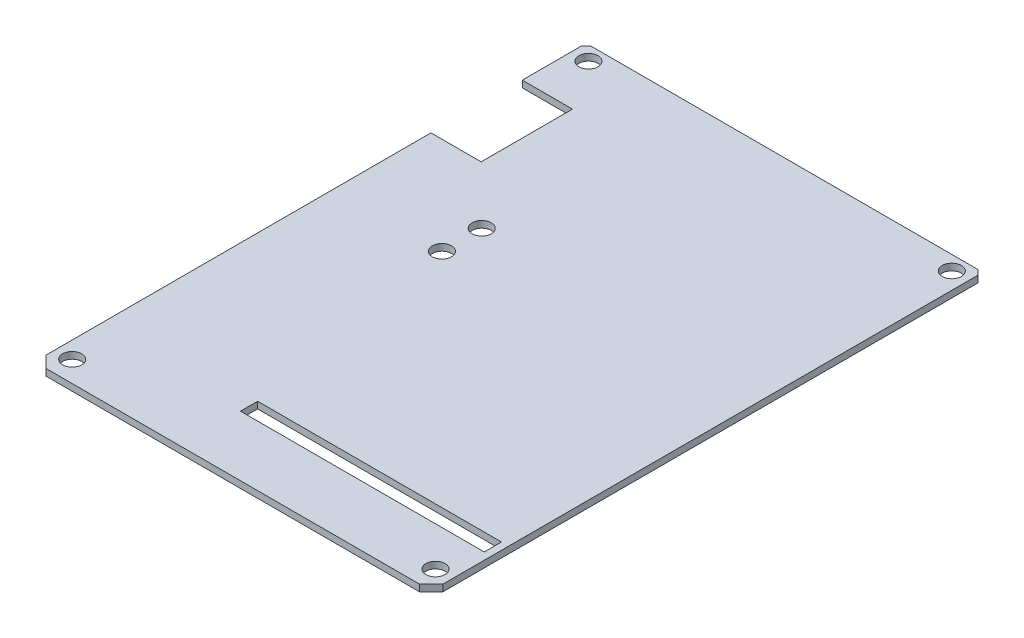
ISO-10303-21;
HEADER;
FILE_DESCRIPTION(('STEP AP214'),'2;1');
FILE_NAME('part.step','',(''),(''),'','','');
FILE_SCHEMA(('AUTOMOTIVE_DESIGN { 1 0 10303 214 1 1 1 1 }'));
ENDSEC;
DATA;
#1=APPLICATION_CONTEXT('core data for automotive mechanical design processes');
#2=APPLICATION_PROTOCOL_DEFINITION('international standard','automotive_design',2000,#1);
#3=PRODUCT_CONTEXT('',#1,'mechanical');
#4=PRODUCT('Part','Part','',(#3));
#5=PRODUCT_RELATED_PRODUCT_CATEGORY('part','',(#4));
#6=PRODUCT_DEFINITION_FORMATION('','',#4);
#7=PRODUCT_DEFINITION_CONTEXT('part definition',#1,'design');
#8=PRODUCT_DEFINITION('design','',#6,#7);
#9=PRODUCT_DEFINITION_SHAPE('','',#8);
#10=(LENGTH_UNIT() NAMED_UNIT(*) SI_UNIT(.MILLI.,.METRE.));
#11=(NAMED_UNIT(*) PLANE_ANGLE_UNIT() SI_UNIT($,.RADIAN.));
#12=(NAMED_UNIT(*) SI_UNIT($,.STERADIAN.) SOLID_ANGLE_UNIT());
#13=UNCERTAINTY_MEASURE_WITH_UNIT(LENGTH_MEASURE(1.E-05),#10,'distance_accuracy_value','');
#14=(GEOMETRIC_REPRESENTATION_CONTEXT(3) GLOBAL_UNCERTAINTY_ASSIGNED_CONTEXT((#13)) GLOBAL_UNIT_ASSIGNED_CONTEXT((#10,
#11,#12)) REPRESENTATION_CONTEXT('',''));
#15=CARTESIAN_POINT('',(0.,0.,0.));
#16=DIRECTION('',(0.,0.,1.));
#17=DIRECTION('',(1.,0.,0.));
#18=AXIS2_PLACEMENT_3D('',#15,#16,#17);
#19=CARTESIAN_POINT('',(-20.75,0.699999999999999,0.));
#20=DIRECTION('',(-1.,0.,0.));
#21=DIRECTION('',(0.,0.,1.));
#22=AXIS2_PLACEMENT_3D('',#19,#20,#21);
#23=PLANE('',#22);
#24=DIRECTION('',(0.,-1.,0.));
#25=VECTOR('',#24,1.);
#26=CARTESIAN_POINT('',(-20.75,0.699999999999999,-21.8236057052935));
#27=LINE('',#26,#25);
#28=CARTESIAN_POINT('',(-20.75,0.699999999999999,-21.8236057052935));
#29=VERTEX_POINT('',#28);
#30=CARTESIAN_POINT('',(-20.75,0.,-21.8236057052935));
#31=VERTEX_POINT('',#30);
#32=EDGE_CURVE('E63',#29,#31,#27,.T.);
#33=ORIENTED_EDGE('',*,*,#32,.F.);
#34=DIRECTION('',(0.,0.,-1.));
#35=VECTOR('',#34,1.);
#36=CARTESIAN_POINT('',(-20.75,0.699999999999999,0.));
#37=LINE('',#36,#35);
#38=CARTESIAN_POINT('',(-20.75,0.699999999999999,-27.9901394034831));
#39=VERTEX_POINT('',#38);
#40=EDGE_CURVE('E195',#29,#39,#37,.T.);
#41=ORIENTED_EDGE('',*,*,#40,.T.);
#42=DIRECTION('',(0.,-1.,0.));
#43=VECTOR('',#42,1.);
#44=CARTESIAN_POINT('',(-20.75,0.699999999999999,-27.9901394034831));
#45=LINE('',#44,#43);
#46=CARTESIAN_POINT('',(-20.75,0.,-27.9901394034831));
#47=VERTEX_POINT('',#46);
#48=EDGE_CURVE('E269',#39,#47,#45,.T.);
#49=ORIENTED_EDGE('',*,*,#48,.T.);
#50=DIRECTION('',(0.,0.,-1.));
#51=VECTOR('',#50,1.);
#52=CARTESIAN_POINT('',(-20.75,0.,0.));
#53=LINE('',#52,#51);
#54=EDGE_CURVE('E250',#31,#47,#53,.T.);
#55=ORIENTED_EDGE('',*,*,#54,.F.);
#56=EDGE_LOOP('',(#33,#41,#49,#55));
#57=FACE_BOUND('',#56,.T.);
#58=ADVANCED_FACE('F54',(#57),#23,.T.);
#59=CARTESIAN_POINT('',(0.,0.699999999999999,0.));
#60=DIRECTION('',(0.,1.,0.));
#61=DIRECTION('',(0.,0.,1.));
#62=AXIS2_PLACEMENT_3D('',#59,#60,#61);
#63=PLANE('',#62);
#64=DIRECTION('',(-1.,0.,0.));
#65=VECTOR('',#64,1.);
#66=CARTESIAN_POINT('',(-20.75,0.699999999999999,-21.8236057052935));
#67=LINE('',#66,#65);
#68=CARTESIAN_POINT('',(-15.5,0.699999999999999,-21.8236057052935));
#69=VERTEX_POINT('',#68);
#70=EDGE_CURVE('E303',#69,#29,#67,.T.);
#71=ORIENTED_EDGE('',*,*,#70,.F.);
#72=DIRECTION('',(0.,0.,-1.));
#73=VECTOR('',#72,1.);
#74=CARTESIAN_POINT('',(-15.5,0.699999999999999,-21.8236057052935));
#75=LINE('',#74,#73);
#76=CARTESIAN_POINT('',(-15.5,0.699999999999999,-12.2736057052935));
#77=VERTEX_POINT('',#76);
#78=EDGE_CURVE('E187',#77,#69,#75,.T.);
#79=ORIENTED_EDGE('',*,*,#78,.F.);
#80=DIRECTION('',(1.,0.,0.));
#81=VECTOR('',#80,1.);
#82=CARTESIAN_POINT('',(-20.75,0.699999999999999,-12.2736057052935));
#83=LINE('',#82,#81);
#84=CARTESIAN_POINT('',(-20.75,0.699999999999999,-12.2736057052935));
#85=VERTEX_POINT('',#84);
#86=EDGE_CURVE('E171',#85,#77,#83,.T.);
#87=ORIENTED_EDGE('',*,*,#86,.F.);
#88=CARTESIAN_POINT('',(-20.75,0.699999999999999,27.9901394034831));
#89=VERTEX_POINT('',#88);
#90=EDGE_CURVE('E185',#89,#85,#37,.T.);
#91=ORIENTED_EDGE('',*,*,#90,.F.);
#92=DIRECTION('',(0.707106781186546,0.,0.707106781186549));
#93=VECTOR('',#92,1.);
#94=CARTESIAN_POINT('',(-24.3700697017416,0.699999999999999,24.3700697017415));
#95=LINE('',#94,#93);
#96=CARTESIAN_POINT('',(-19.5401394034831,0.699999999999999,29.2));
#97=VERTEX_POINT('',#96);
#98=EDGE_CURVE('E194',#89,#97,#95,.T.);
#99=ORIENTED_EDGE('',*,*,#98,.T.);
#100=DIRECTION('',(1.,0.,0.));
#101=VECTOR('',#100,1.);
#102=CARTESIAN_POINT('',(-19.5401394034831,0.699999999999999,29.2));
#103=LINE('',#102,#101);
#104=CARTESIAN_POINT('',(19.5401394034831,0.699999999999999,29.2));
#105=VERTEX_POINT('',#104);
#106=EDGE_CURVE('E311',#97,#105,#103,.T.);
#107=ORIENTED_EDGE('',*,*,#106,.T.);
#108=DIRECTION('',(-0.707106781186546,0.,0.707106781186549));
#109=VECTOR('',#108,1.);
#110=CARTESIAN_POINT('',(24.3700697017416,0.699999999999999,24.3700697017415));
#111=LINE('',#110,#109);
#112=CARTESIAN_POINT('',(20.75,0.699999999999999,27.9901394034831));
#113=VERTEX_POINT('',#112);
#114=EDGE_CURVE('E200',#113,#105,#111,.T.);
#115=ORIENTED_EDGE('',*,*,#114,.F.);
#116=DIRECTION('',(0.,0.,1.));
#117=VECTOR('',#116,1.);
#118=CARTESIAN_POINT('',(20.75,0.699999999999999,0.));
#119=LINE('',#118,#117);
#120=CARTESIAN_POINT('',(20.75,0.699999999999999,-27.9901394034831));
#121=VERTEX_POINT('',#120);
#122=EDGE_CURVE('E419',#121,#113,#119,.T.);
#123=ORIENTED_EDGE('',*,*,#122,.F.);
#124=DIRECTION('',(-0.707106781186546,0.,-0.707106781186549));
#125=VECTOR('',#124,1.);
#126=CARTESIAN_POINT('',(24.3700697017416,0.699999999999999,-24.3700697017415));
#127=LINE('',#126,#125);
#128=CARTESIAN_POINT('',(20.2401394034831,0.699999999999999,-28.5));
#129=VERTEX_POINT('',#128);
#130=EDGE_CURVE('E423',#121,#129,#127,.T.);
#131=ORIENTED_EDGE('',*,*,#130,.T.);
#132=DIRECTION('',(1.,0.,0.));
#133=VECTOR('',#132,1.);
#134=CARTESIAN_POINT('',(0.,0.699999999999999,-28.5));
#135=LINE('',#134,#133);
#136=CARTESIAN_POINT('',(-20.2401394034831,0.699999999999999,-28.5));
#137=VERTEX_POINT('',#136);
#138=EDGE_CURVE('E425',#137,#129,#135,.T.);
#139=ORIENTED_EDGE('',*,*,#138,.F.);
#140=DIRECTION('',(0.707106781186546,0.,-0.707106781186549));
#141=VECTOR('',#140,1.);
#142=CARTESIAN_POINT('',(-24.3700697017416,0.699999999999999,-24.3700697017415));
#143=LINE('',#142,#141);
#144=EDGE_CURVE('E202',#39,#137,#143,.T.);
#145=ORIENTED_EDGE('',*,*,#144,.F.);
#146=ORIENTED_EDGE('',*,*,#40,.F.);
#147=EDGE_LOOP('',(#71,#79,#87,#91,#99,#107,#115,#123,#131,#139,#145,#146));
#148=FACE_BOUND('',#147,.T.);
#149=CARTESIAN_POINT('',(-9.45,0.699999999999999,-2.11546981112506));
#150=DIRECTION('',(0.,1.,0.));
#151=DIRECTION('',(0.,0.,1.));
#152=AXIS2_PLACEMENT_3D('',#149,#150,#151);
#153=CIRCLE('',#152,1.);
#154=CARTESIAN_POINT('',(-9.45,0.699999999999999,-1.11546981112506));
#155=VERTEX_POINT('',#154);
#156=EDGE_CURVE('E264',#155,#155,#153,.T.);
#157=ORIENTED_EDGE('',*,*,#156,.F.);
#158=EDGE_LOOP('',(#157));
#159=FACE_BOUND('',#158,.T.);
#160=CARTESIAN_POINT('',(-19.,0.699999999999999,-27.));
#161=DIRECTION('',(0.,1.,0.));
#162=DIRECTION('',(0.,0.,1.));
#163=AXIS2_PLACEMENT_3D('',#160,#161,#162);
#164=CIRCLE('',#163,1.);
#165=CARTESIAN_POINT('',(-19.,0.699999999999999,-26.));
#166=VERTEX_POINT('',#165);
#167=EDGE_CURVE('E403',#166,#166,#164,.F.);
#168=ORIENTED_EDGE('',*,*,#167,.T.);
#169=EDGE_LOOP('',(#168));
#170=FACE_BOUND('',#169,.T.);
#171=CARTESIAN_POINT('',(19.,0.699999999999999,27.));
#172=DIRECTION('',(0.,1.,0.));
#173=DIRECTION('',(0.,0.,1.));
#174=AXIS2_PLACEMENT_3D('',#171,#172,#173);
#175=CIRCLE('',#174,1.);
#176=CARTESIAN_POINT('',(19.,0.699999999999999,28.));
#177=VERTEX_POINT('',#176);
#178=EDGE_CURVE('E407',#177,#177,#175,.T.);
#179=ORIENTED_EDGE('',*,*,#178,.F.);
#180=EDGE_LOOP('',(#179));
#181=FACE_BOUND('',#180,.T.);
#182=CARTESIAN_POINT('',(-19.,0.699999999999999,27.));
#183=DIRECTION('',(0.,1.,0.));
#184=DIRECTION('',(0.,0.,1.));
#185=AXIS2_PLACEMENT_3D('',#182,#183,#184);
#186=CIRCLE('',#185,1.);
#187=CARTESIAN_POINT('',(-19.,0.699999999999999,28.));
#188=VERTEX_POINT('',#187);
#189=EDGE_CURVE('E411',#188,#188,#186,.T.);
#190=ORIENTED_EDGE('',*,*,#189,.F.);
#191=EDGE_LOOP('',(#190));
#192=FACE_BOUND('',#191,.T.);
#193=CARTESIAN_POINT('',(-9.45,0.699999999999999,-6.28453018887489));
#194=DIRECTION('',(0.,1.,0.));
#195=DIRECTION('',(0.,0.,1.));
#196=AXIS2_PLACEMENT_3D('',#193,#194,#195);
#197=CIRCLE('',#196,0.999999999999998);
#198=CARTESIAN_POINT('',(-9.45,0.699999999999999,-5.28453018887489));
#199=VERTEX_POINT('',#198);
#200=EDGE_CURVE('E415',#199,#199,#197,.T.);
#201=ORIENTED_EDGE('',*,*,#200,.F.);
#202=EDGE_LOOP('',(#201));
#203=FACE_BOUND('',#202,.T.);
#204=CARTESIAN_POINT('',(19.,0.699999999999999,-27.));
#205=DIRECTION('',(0.,1.,0.));
#206=DIRECTION('',(0.,0.,1.));
#207=AXIS2_PLACEMENT_3D('',#204,#205,#206);
#208=CIRCLE('',#207,1.);
#209=CARTESIAN_POINT('',(19.,0.699999999999999,-26.));
#210=VERTEX_POINT('',#209);
#211=EDGE_CURVE('E208',#210,#210,#208,.F.);
#212=ORIENTED_EDGE('',*,*,#211,.T.);
#213=EDGE_LOOP('',(#212));
#214=FACE_BOUND('',#213,.T.);
#215=DIRECTION('',(0.,0.,1.));
#216=VECTOR('',#215,1.);
#217=CARTESIAN_POINT('',(-5.50287843796126,0.699999999999999,0.));
#218=LINE('',#217,#216);
#219=CARTESIAN_POINT('',(-5.50287843796126,0.699999999999999,21.1));
#220=VERTEX_POINT('',#219);
#221=CARTESIAN_POINT('',(-5.50287843796126,0.699999999999999,22.9));
#222=VERTEX_POINT('',#221);
#223=EDGE_CURVE('E352',#220,#222,#218,.T.);
#224=ORIENTED_EDGE('',*,*,#223,.F.);
#225=DIRECTION('',(1.,0.,0.));
#226=VECTOR('',#225,1.);
#227=CARTESIAN_POINT('',(0.,0.699999999999999,21.1));
#228=LINE('',#227,#226);
#229=CARTESIAN_POINT('',(20.,0.699999999999999,21.1));
#230=VERTEX_POINT('',#229);
#231=EDGE_CURVE('E78',#220,#230,#228,.T.);
#232=ORIENTED_EDGE('',*,*,#231,.T.);
#233=DIRECTION('',(0.,0.,-1.));
#234=VECTOR('',#233,1.);
#235=CARTESIAN_POINT('',(20.,0.699999999999999,0.));
#236=LINE('',#235,#234);
#237=CARTESIAN_POINT('',(20.,0.699999999999999,22.9));
#238=VERTEX_POINT('',#237);
#239=EDGE_CURVE('E342',#238,#230,#236,.T.);
#240=ORIENTED_EDGE('',*,*,#239,.F.);
#241=DIRECTION('',(1.,0.,0.));
#242=VECTOR('',#241,1.);
#243=CARTESIAN_POINT('',(0.,0.699999999999999,22.9));
#244=LINE('',#243,#242);
#245=EDGE_CURVE('E347',#222,#238,#244,.T.);
#246=ORIENTED_EDGE('',*,*,#245,.F.);
#247=EDGE_LOOP('',(#224,#232,#240,#246));
#248=FACE_BOUND('',#247,.T.);
#249=ADVANCED_FACE('F183',(#148,#159,#170,#181,#192,#203,#214,#248),#63,.T.);
#250=CARTESIAN_POINT('',(0.,0.,0.));
#251=DIRECTION('',(0.,1.,0.));
#252=DIRECTION('',(0.,0.,1.));
#253=AXIS2_PLACEMENT_3D('',#250,#251,#252);
#254=PLANE('',#253);
#255=CARTESIAN_POINT('',(19.,0.,-27.));
#256=DIRECTION('',(0.,1.,0.));
#257=DIRECTION('',(0.,0.,1.));
#258=AXIS2_PLACEMENT_3D('',#255,#256,#257);
#259=CIRCLE('',#258,1.);
#260=CARTESIAN_POINT('',(19.,0.,-26.));
#261=VERTEX_POINT('',#260);
#262=EDGE_CURVE('E260',#261,#261,#259,.F.);
#263=ORIENTED_EDGE('',*,*,#262,.F.);
#264=EDGE_LOOP('',(#263));
#265=FACE_BOUND('',#264,.T.);
#266=DIRECTION('',(0.,0.,-1.));
#267=VECTOR('',#266,1.);
#268=CARTESIAN_POINT('',(-15.5,0.,0.));
#269=LINE('',#268,#267);
#270=CARTESIAN_POINT('',(-15.5,0.,-12.2736057052935));
#271=VERTEX_POINT('',#270);
#272=CARTESIAN_POINT('',(-15.5,0.,-21.8236057052935));
#273=VERTEX_POINT('',#272);
#274=EDGE_CURVE('E13',#271,#273,#269,.T.);
#275=ORIENTED_EDGE('',*,*,#274,.T.);
#276=DIRECTION('',(-1.,0.,0.));
#277=VECTOR('',#276,1.);
#278=CARTESIAN_POINT('',(0.,0.,-21.8236057052935));
#279=LINE('',#278,#277);
#280=EDGE_CURVE('E301',#273,#31,#279,.T.);
#281=ORIENTED_EDGE('',*,*,#280,.T.);
#282=ORIENTED_EDGE('',*,*,#54,.T.);
#283=DIRECTION('',(0.707106781186546,0.,-0.707106781186549));
#284=VECTOR('',#283,1.);
#285=CARTESIAN_POINT('',(-24.3700697017416,0.,-24.3700697017415));
#286=LINE('',#285,#284);
#287=CARTESIAN_POINT('',(-20.2401394034831,0.,-28.5));
#288=VERTEX_POINT('',#287);
#289=EDGE_CURVE('E246',#47,#288,#286,.T.);
#290=ORIENTED_EDGE('',*,*,#289,.T.);
#291=DIRECTION('',(1.,0.,0.));
#292=VECTOR('',#291,1.);
#293=CARTESIAN_POINT('',(0.,0.,-28.5));
#294=LINE('',#293,#292);
#295=CARTESIAN_POINT('',(20.2401394034831,0.,-28.5));
#296=VERTEX_POINT('',#295);
#297=EDGE_CURVE('E242',#288,#296,#294,.T.);
#298=ORIENTED_EDGE('',*,*,#297,.T.);
#299=DIRECTION('',(-0.707106781186546,0.,-0.707106781186549));
#300=VECTOR('',#299,1.);
#301=CARTESIAN_POINT('',(24.3700697017416,0.,-24.3700697017415));
#302=LINE('',#301,#300);
#303=CARTESIAN_POINT('',(20.75,0.,-27.9901394034831));
#304=VERTEX_POINT('',#303);
#305=EDGE_CURVE('E238',#304,#296,#302,.T.);
#306=ORIENTED_EDGE('',*,*,#305,.F.);
#307=DIRECTION('',(0.,0.,1.));
#308=VECTOR('',#307,1.);
#309=CARTESIAN_POINT('',(20.75,0.,0.));
#310=LINE('',#309,#308);
#311=CARTESIAN_POINT('',(20.75,0.,27.9901394034831));
#312=VERTEX_POINT('',#311);
#313=EDGE_CURVE('E234',#304,#312,#310,.T.);
#314=ORIENTED_EDGE('',*,*,#313,.T.);
#315=DIRECTION('',(-0.707106781186546,0.,0.707106781186549));
#316=VECTOR('',#315,1.);
#317=CARTESIAN_POINT('',(24.3700697017416,0.,24.3700697017415));
#318=LINE('',#317,#316);
#319=CARTESIAN_POINT('',(19.5401394034831,0.,29.2));
#320=VERTEX_POINT('',#319);
#321=EDGE_CURVE('E257',#312,#320,#318,.T.);
#322=ORIENTED_EDGE('',*,*,#321,.T.);
#323=DIRECTION('',(-1.,0.,0.));
#324=VECTOR('',#323,1.);
#325=CARTESIAN_POINT('',(-19.5401394034831,0.,29.2));
#326=LINE('',#325,#324);
#327=CARTESIAN_POINT('',(-19.5401394034831,0.,29.2));
#328=VERTEX_POINT('',#327);
#329=EDGE_CURVE('E360',#320,#328,#326,.T.);
#330=ORIENTED_EDGE('',*,*,#329,.T.);
#331=DIRECTION('',(0.707106781186546,0.,0.707106781186549));
#332=VECTOR('',#331,1.);
#333=CARTESIAN_POINT('',(-24.3700697017416,0.,24.3700697017415));
#334=LINE('',#333,#332);
#335=CARTESIAN_POINT('',(-20.75,0.,27.9901394034831));
#336=VERTEX_POINT('',#335);
#337=EDGE_CURVE('E254',#336,#328,#334,.T.);
#338=ORIENTED_EDGE('',*,*,#337,.F.);
#339=CARTESIAN_POINT('',(-20.75,0.,-12.2736057052935));
#340=VERTEX_POINT('',#339);
#341=EDGE_CURVE('E251',#336,#340,#53,.T.);
#342=ORIENTED_EDGE('',*,*,#341,.T.);
#343=DIRECTION('',(1.,0.,0.));
#344=VECTOR('',#343,1.);
#345=CARTESIAN_POINT('',(0.,0.,-12.2736057052935));
#346=LINE('',#345,#344);
#347=EDGE_CURVE('E70',#340,#271,#346,.T.);
#348=ORIENTED_EDGE('',*,*,#347,.T.);
#349=EDGE_LOOP('',(#275,#281,#282,#290,#298,#306,#314,#322,#330,#338,#342,#348));
#350=FACE_BOUND('',#349,.T.);
#351=CARTESIAN_POINT('',(-9.45,0.,-6.28453018887489));
#352=DIRECTION('',(0.,1.,0.));
#353=DIRECTION('',(0.,0.,1.));
#354=AXIS2_PLACEMENT_3D('',#351,#352,#353);
#355=CIRCLE('',#354,0.999999999999998);
#356=CARTESIAN_POINT('',(-9.45,0.,-5.28453018887489));
#357=VERTEX_POINT('',#356);
#358=EDGE_CURVE('E230',#357,#357,#355,.T.);
#359=ORIENTED_EDGE('',*,*,#358,.T.);
#360=EDGE_LOOP('',(#359));
#361=FACE_BOUND('',#360,.T.);
#362=CARTESIAN_POINT('',(-19.,0.,27.));
#363=DIRECTION('',(0.,1.,0.));
#364=DIRECTION('',(0.,0.,1.));
#365=AXIS2_PLACEMENT_3D('',#362,#363,#364);
#366=CIRCLE('',#365,1.);
#367=CARTESIAN_POINT('',(-19.,0.,28.));
#368=VERTEX_POINT('',#367);
#369=EDGE_CURVE('E226',#368,#368,#366,.T.);
#370=ORIENTED_EDGE('',*,*,#369,.T.);
#371=EDGE_LOOP('',(#370));
#372=FACE_BOUND('',#371,.T.);
#373=CARTESIAN_POINT('',(19.,0.,27.));
#374=DIRECTION('',(0.,1.,0.));
#375=DIRECTION('',(0.,0.,1.));
#376=AXIS2_PLACEMENT_3D('',#373,#374,#375);
#377=CIRCLE('',#376,1.);
#378=CARTESIAN_POINT('',(19.,0.,28.));
#379=VERTEX_POINT('',#378);
#380=EDGE_CURVE('E222',#379,#379,#377,.T.);
#381=ORIENTED_EDGE('',*,*,#380,.T.);
#382=EDGE_LOOP('',(#381));
#383=FACE_BOUND('',#382,.T.);
#384=CARTESIAN_POINT('',(-19.,0.,-27.));
#385=DIRECTION('',(0.,1.,0.));
#386=DIRECTION('',(0.,0.,1.));
#387=AXIS2_PLACEMENT_3D('',#384,#385,#386);
#388=CIRCLE('',#387,1.);
#389=CARTESIAN_POINT('',(-19.,0.,-26.));
#390=VERTEX_POINT('',#389);
#391=EDGE_CURVE('E217',#390,#390,#388,.F.);
#392=ORIENTED_EDGE('',*,*,#391,.F.);
#393=EDGE_LOOP('',(#392));
#394=FACE_BOUND('',#393,.T.);
#395=CARTESIAN_POINT('',(-9.45,0.,-2.11546981112506));
#396=DIRECTION('',(0.,1.,0.));
#397=DIRECTION('',(0.,0.,1.));
#398=AXIS2_PLACEMENT_3D('',#395,#396,#397);
#399=CIRCLE('',#398,1.);
#400=CARTESIAN_POINT('',(-9.45,0.,-1.11546981112506));
#401=VERTEX_POINT('',#400);
#402=EDGE_CURVE('E213',#401,#401,#399,.T.);
#403=ORIENTED_EDGE('',*,*,#402,.T.);
#404=EDGE_LOOP('',(#403));
#405=FACE_BOUND('',#404,.T.);
#406=DIRECTION('',(1.,0.,0.));
#407=VECTOR('',#406,1.);
#408=CARTESIAN_POINT('',(0.,0.,21.1));
#409=LINE('',#408,#407);
#410=CARTESIAN_POINT('',(-5.50287843796126,0.,21.1));
#411=VERTEX_POINT('',#410);
#412=CARTESIAN_POINT('',(20.,0.,21.1));
#413=VERTEX_POINT('',#412);
#414=EDGE_CURVE('E178',#411,#413,#409,.T.);
#415=ORIENTED_EDGE('',*,*,#414,.F.);
#416=DIRECTION('',(0.,0.,1.));
#417=VECTOR('',#416,1.);
#418=CARTESIAN_POINT('',(-5.50287843796126,0.,0.));
#419=LINE('',#418,#417);
#420=CARTESIAN_POINT('',(-5.50287843796126,0.,22.9));
#421=VERTEX_POINT('',#420);
#422=EDGE_CURVE('E282',#411,#421,#419,.T.);
#423=ORIENTED_EDGE('',*,*,#422,.T.);
#424=DIRECTION('',(1.,0.,0.));
#425=VECTOR('',#424,1.);
#426=CARTESIAN_POINT('',(0.,0.,22.9));
#427=LINE('',#426,#425);
#428=CARTESIAN_POINT('',(20.,0.,22.9));
#429=VERTEX_POINT('',#428);
#430=EDGE_CURVE('E286',#421,#429,#427,.T.);
#431=ORIENTED_EDGE('',*,*,#430,.T.);
#432=DIRECTION('',(0.,0.,-1.));
#433=VECTOR('',#432,1.);
#434=CARTESIAN_POINT('',(20.,0.,0.));
#435=LINE('',#434,#433);
#436=EDGE_CURVE('E290',#429,#413,#435,.T.);
#437=ORIENTED_EDGE('',*,*,#436,.T.);
#438=EDGE_LOOP('',(#415,#423,#431,#437));
#439=FACE_BOUND('',#438,.T.);
#440=ADVANCED_FACE('F308',(#265,#350,#361,#372,#383,#394,#405,#439),#254,.F.);
#441=CARTESIAN_POINT('',(20.75,0.699999999999999,0.));
#442=DIRECTION('',(1.,0.,0.));
#443=DIRECTION('',(0.,0.,-1.));
#444=AXIS2_PLACEMENT_3D('',#441,#442,#443);
#445=PLANE('',#444);
#446=ORIENTED_EDGE('',*,*,#313,.F.);
#447=DIRECTION('',(0.,-1.,0.));
#448=VECTOR('',#447,1.);
#449=CARTESIAN_POINT('',(20.75,0.699999999999999,-27.9901394034831));
#450=LINE('',#449,#448);
#451=EDGE_CURVE('E279',#121,#304,#450,.T.);
#452=ORIENTED_EDGE('',*,*,#451,.F.);
#453=ORIENTED_EDGE('',*,*,#122,.T.);
#454=DIRECTION('',(0.,-1.,0.));
#455=VECTOR('',#454,1.);
#456=CARTESIAN_POINT('',(20.75,0.699999999999999,27.9901394034831));
#457=LINE('',#456,#455);
#458=EDGE_CURVE('E212',#113,#312,#457,.T.);
#459=ORIENTED_EDGE('',*,*,#458,.T.);
#460=EDGE_LOOP('',(#446,#452,#453,#459));
#461=FACE_BOUND('',#460,.T.);
#462=ADVANCED_FACE('F449',(#461),#445,.T.);
#463=CARTESIAN_POINT('',(24.3700697017416,0.699999999999999,-24.3700697017415));
#464=DIRECTION('',(-0.707106781186549,0.,0.707106781186546));
#465=DIRECTION('',(0.707106781186546,0.,0.707106781186549));
#466=AXIS2_PLACEMENT_3D('',#463,#464,#465);
#467=PLANE('',#466);
#468=ORIENTED_EDGE('',*,*,#305,.T.);
#469=DIRECTION('',(0.,-1.,0.));
#470=VECTOR('',#469,1.);
#471=CARTESIAN_POINT('',(20.2401394034831,0.699999999999999,-28.5));
#472=LINE('',#471,#470);
#473=EDGE_CURVE('E276',#129,#296,#472,.T.);
#474=ORIENTED_EDGE('',*,*,#473,.F.);
#475=ORIENTED_EDGE('',*,*,#130,.F.);
#476=ORIENTED_EDGE('',*,*,#451,.T.);
#477=EDGE_LOOP('',(#468,#474,#475,#476));
#478=FACE_BOUND('',#477,.T.);
#479=ADVANCED_FACE('F443',(#478),#467,.F.);
#480=CARTESIAN_POINT('',(0.,0.699999999999999,-28.5));
#481=DIRECTION('',(0.,0.,-1.));
#482=DIRECTION('',(-1.,0.,0.));
#483=AXIS2_PLACEMENT_3D('',#480,#481,#482);
#484=PLANE('',#483);
#485=ORIENTED_EDGE('',*,*,#297,.F.);
#486=DIRECTION('',(0.,-1.,0.));
#487=VECTOR('',#486,1.);
#488=CARTESIAN_POINT('',(-20.2401394034831,0.699999999999999,-28.5));
#489=LINE('',#488,#487);
#490=EDGE_CURVE('E273',#137,#288,#489,.T.);
#491=ORIENTED_EDGE('',*,*,#490,.F.);
#492=ORIENTED_EDGE('',*,*,#138,.T.);
#493=ORIENTED_EDGE('',*,*,#473,.T.);
#494=EDGE_LOOP('',(#485,#491,#492,#493));
#495=FACE_BOUND('',#494,.T.);
#496=ADVANCED_FACE('F445',(#495),#484,.T.);
#497=CARTESIAN_POINT('',(-24.3700697017416,0.699999999999999,-24.3700697017415));
#498=DIRECTION('',(-0.707106781186549,0.,-0.707106781186546));
#499=DIRECTION('',(-0.707106781186546,0.,0.707106781186549));
#500=AXIS2_PLACEMENT_3D('',#497,#498,#499);
#501=PLANE('',#500);
#502=ORIENTED_EDGE('',*,*,#289,.F.);
#503=ORIENTED_EDGE('',*,*,#48,.F.);
#504=ORIENTED_EDGE('',*,*,#144,.T.);
#505=ORIENTED_EDGE('',*,*,#490,.T.);
#506=EDGE_LOOP('',(#502,#503,#504,#505));
#507=FACE_BOUND('',#506,.T.);
#508=ADVANCED_FACE('F436',(#507),#501,.T.);
#509=DIRECTION('',(0.,1.,0.));
#510=VECTOR('',#509,1.);
#511=CARTESIAN_POINT('',(-20.75,0.699999999999999,-12.2736057052935));
#512=LINE('',#511,#510);
#513=EDGE_CURVE('E168',#340,#85,#512,.T.);
#514=ORIENTED_EDGE('',*,*,#513,.F.);
#515=ORIENTED_EDGE('',*,*,#341,.F.);
#516=DIRECTION('',(0.,-1.,0.));
#517=VECTOR('',#516,1.);
#518=CARTESIAN_POINT('',(-20.75,0.699999999999999,27.9901394034831));
#519=LINE('',#518,#517);
#520=EDGE_CURVE('E191',#89,#336,#519,.T.);
#521=ORIENTED_EDGE('',*,*,#520,.F.);
#522=ORIENTED_EDGE('',*,*,#90,.T.);
#523=EDGE_LOOP('',(#514,#515,#521,#522));
#524=FACE_BOUND('',#523,.T.);
#525=ADVANCED_FACE('F190',(#524),#23,.T.);
#526=CARTESIAN_POINT('',(-24.3700697017416,0.699999999999999,24.3700697017415));
#527=DIRECTION('',(0.707106781186549,0.,-0.707106781186546));
#528=DIRECTION('',(-0.707106781186546,0.,-0.707106781186549));
#529=AXIS2_PLACEMENT_3D('',#526,#527,#528);
#530=PLANE('',#529);
#531=ORIENTED_EDGE('',*,*,#337,.T.);
#532=DIRECTION('',(0.,1.,0.));
#533=VECTOR('',#532,1.);
#534=CARTESIAN_POINT('',(-19.5401394034831,-40.4863306844386,29.2));
#535=LINE('',#534,#533);
#536=EDGE_CURVE('E370',#328,#97,#535,.T.);
#537=ORIENTED_EDGE('',*,*,#536,.T.);
#538=ORIENTED_EDGE('',*,*,#98,.F.);
#539=ORIENTED_EDGE('',*,*,#520,.T.);
#540=EDGE_LOOP('',(#531,#537,#538,#539));
#541=FACE_BOUND('',#540,.T.);
#542=ADVANCED_FACE('F460',(#541),#530,.F.);
#543=CARTESIAN_POINT('',(24.3700697017416,0.699999999999999,24.3700697017415));
#544=DIRECTION('',(0.707106781186549,0.,0.707106781186546));
#545=DIRECTION('',(0.707106781186546,0.,-0.707106781186549));
#546=AXIS2_PLACEMENT_3D('',#543,#544,#545);
#547=PLANE('',#546);
#548=ORIENTED_EDGE('',*,*,#321,.F.);
#549=ORIENTED_EDGE('',*,*,#458,.F.);
#550=ORIENTED_EDGE('',*,*,#114,.T.);
#551=DIRECTION('',(0.,1.,0.));
#552=VECTOR('',#551,1.);
#553=CARTESIAN_POINT('',(19.5401394034831,-40.4863306844386,29.2));
#554=LINE('',#553,#552);
#555=EDGE_CURVE('E365',#320,#105,#554,.T.);
#556=ORIENTED_EDGE('',*,*,#555,.F.);
#557=EDGE_LOOP('',(#548,#549,#550,#556));
#558=FACE_BOUND('',#557,.T.);
#559=ADVANCED_FACE('F451',(#558),#547,.T.);
#560=CARTESIAN_POINT('',(-9.45,0.699999999999999,-6.28453018887489));
#561=DIRECTION('',(0.,-1.,0.));
#562=DIRECTION('',(0.,0.,-1.));
#563=AXIS2_PLACEMENT_3D('',#560,#561,#562);
#564=CYLINDRICAL_SURFACE('',#563,0.999999999999998);
#565=ORIENTED_EDGE('',*,*,#200,.T.);
#566=EDGE_LOOP('',(#565));
#567=FACE_BOUND('',#566,.T.);
#568=ORIENTED_EDGE('',*,*,#358,.F.);
#569=EDGE_LOOP('',(#568));
#570=FACE_BOUND('',#569,.T.);
#571=ADVANCED_FACE('F467',(#567,#570),#564,.F.);
#572=CARTESIAN_POINT('',(-19.,0.699999999999999,27.));
#573=DIRECTION('',(0.,-1.,0.));
#574=DIRECTION('',(0.,0.,-1.));
#575=AXIS2_PLACEMENT_3D('',#572,#573,#574);
#576=CYLINDRICAL_SURFACE('',#575,1.);
#577=ORIENTED_EDGE('',*,*,#189,.T.);
#578=EDGE_LOOP('',(#577));
#579=FACE_BOUND('',#578,.T.);
#580=ORIENTED_EDGE('',*,*,#369,.F.);
#581=EDGE_LOOP('',(#580));
#582=FACE_BOUND('',#581,.T.);
#583=ADVANCED_FACE('F486',(#579,#582),#576,.F.);
#584=CARTESIAN_POINT('',(19.,0.699999999999999,27.));
#585=DIRECTION('',(0.,-1.,0.));
#586=DIRECTION('',(0.,0.,-1.));
#587=AXIS2_PLACEMENT_3D('',#584,#585,#586);
#588=CYLINDRICAL_SURFACE('',#587,1.);
#589=ORIENTED_EDGE('',*,*,#178,.T.);
#590=EDGE_LOOP('',(#589));
#591=FACE_BOUND('',#590,.T.);
#592=ORIENTED_EDGE('',*,*,#380,.F.);
#593=EDGE_LOOP('',(#592));
#594=FACE_BOUND('',#593,.T.);
#595=ADVANCED_FACE('F490',(#591,#594),#588,.F.);
#596=CARTESIAN_POINT('',(-19.,0.699999999999999,-27.));
#597=DIRECTION('',(0.,-1.,0.));
#598=DIRECTION('',(0.,0.,-1.));
#599=AXIS2_PLACEMENT_3D('',#596,#597,#598);
#600=CYLINDRICAL_SURFACE('',#599,1.);
#601=ORIENTED_EDGE('',*,*,#167,.F.);
#602=EDGE_LOOP('',(#601));
#603=FACE_BOUND('',#602,.T.);
#604=ORIENTED_EDGE('',*,*,#391,.T.);
#605=EDGE_LOOP('',(#604));
#606=FACE_BOUND('',#605,.T.);
#607=ADVANCED_FACE('F493',(#603,#606),#600,.F.);
#608=CARTESIAN_POINT('',(-9.45,0.699999999999999,-2.11546981112506));
#609=DIRECTION('',(0.,-1.,0.));
#610=DIRECTION('',(0.,0.,-1.));
#611=AXIS2_PLACEMENT_3D('',#608,#609,#610);
#612=CYLINDRICAL_SURFACE('',#611,1.);
#613=ORIENTED_EDGE('',*,*,#156,.T.);
#614=EDGE_LOOP('',(#613));
#615=FACE_BOUND('',#614,.T.);
#616=ORIENTED_EDGE('',*,*,#402,.F.);
#617=EDGE_LOOP('',(#616));
#618=FACE_BOUND('',#617,.T.);
#619=ADVANCED_FACE('F56',(#615,#618),#612,.F.);
#620=CARTESIAN_POINT('',(19.,0.699999999999999,-27.));
#621=DIRECTION('',(0.,-1.,0.));
#622=DIRECTION('',(0.,0.,-1.));
#623=AXIS2_PLACEMENT_3D('',#620,#621,#622);
#624=CYLINDRICAL_SURFACE('',#623,1.);
#625=ORIENTED_EDGE('',*,*,#211,.F.);
#626=EDGE_LOOP('',(#625));
#627=FACE_BOUND('',#626,.T.);
#628=ORIENTED_EDGE('',*,*,#262,.T.);
#629=EDGE_LOOP('',(#628));
#630=FACE_BOUND('',#629,.T.);
#631=ADVANCED_FACE('F500',(#627,#630),#624,.F.);
#632=CARTESIAN_POINT('',(0.,-9.3,21.1));
#633=DIRECTION('',(0.,0.,1.));
#634=DIRECTION('',(1.,0.,0.));
#635=AXIS2_PLACEMENT_3D('',#632,#633,#634);
#636=PLANE('',#635);
#637=ORIENTED_EDGE('',*,*,#414,.T.);
#638=DIRECTION('',(0.,1.,0.));
#639=VECTOR('',#638,1.);
#640=CARTESIAN_POINT('',(20.,-9.3,21.1));
#641=LINE('',#640,#639);
#642=EDGE_CURVE('E218',#413,#230,#641,.T.);
#643=ORIENTED_EDGE('',*,*,#642,.T.);
#644=ORIENTED_EDGE('',*,*,#231,.F.);
#645=DIRECTION('',(0.,1.,0.));
#646=VECTOR('',#645,1.);
#647=CARTESIAN_POINT('',(-5.50287843796126,-9.3,21.1));
#648=LINE('',#647,#646);
#649=EDGE_CURVE('E338',#411,#220,#648,.T.);
#650=ORIENTED_EDGE('',*,*,#649,.F.);
#651=EDGE_LOOP('',(#637,#643,#644,#650));
#652=FACE_BOUND('',#651,.T.);
#653=ADVANCED_FACE('F514',(#652),#636,.T.);
#654=CARTESIAN_POINT('',(20.,-9.3,0.));
#655=DIRECTION('',(1.,0.,0.));
#656=DIRECTION('',(0.,0.,-1.));
#657=AXIS2_PLACEMENT_3D('',#654,#655,#656);
#658=PLANE('',#657);
#659=DIRECTION('',(0.,1.,0.));
#660=VECTOR('',#659,1.);
#661=CARTESIAN_POINT('',(20.,-9.3,22.9));
#662=LINE('',#661,#660);
#663=EDGE_CURVE('E330',#429,#238,#662,.T.);
#664=ORIENTED_EDGE('',*,*,#663,.T.);
#665=ORIENTED_EDGE('',*,*,#239,.T.);
#666=ORIENTED_EDGE('',*,*,#642,.F.);
#667=ORIENTED_EDGE('',*,*,#436,.F.);
#668=EDGE_LOOP('',(#664,#665,#666,#667));
#669=FACE_BOUND('',#668,.T.);
#670=ADVANCED_FACE('F516',(#669),#658,.F.);
#671=CARTESIAN_POINT('',(0.,-9.3,22.9));
#672=DIRECTION('',(0.,0.,1.));
#673=DIRECTION('',(1.,0.,0.));
#674=AXIS2_PLACEMENT_3D('',#671,#672,#673);
#675=PLANE('',#674);
#676=DIRECTION('',(0.,1.,0.));
#677=VECTOR('',#676,1.);
#678=CARTESIAN_POINT('',(-5.50287843796126,-9.3,22.9));
#679=LINE('',#678,#677);
#680=EDGE_CURVE('E334',#421,#222,#679,.T.);
#681=ORIENTED_EDGE('',*,*,#680,.T.);
#682=ORIENTED_EDGE('',*,*,#245,.T.);
#683=ORIENTED_EDGE('',*,*,#663,.F.);
#684=ORIENTED_EDGE('',*,*,#430,.F.);
#685=EDGE_LOOP('',(#681,#682,#683,#684));
#686=FACE_BOUND('',#685,.T.);
#687=ADVANCED_FACE('F526',(#686),#675,.F.);
#688=CARTESIAN_POINT('',(-5.50287843796126,-9.3,0.));
#689=DIRECTION('',(-1.,0.,0.));
#690=DIRECTION('',(0.,0.,1.));
#691=AXIS2_PLACEMENT_3D('',#688,#689,#690);
#692=PLANE('',#691);
#693=ORIENTED_EDGE('',*,*,#649,.T.);
#694=ORIENTED_EDGE('',*,*,#223,.T.);
#695=ORIENTED_EDGE('',*,*,#680,.F.);
#696=ORIENTED_EDGE('',*,*,#422,.F.);
#697=EDGE_LOOP('',(#693,#694,#695,#696));
#698=FACE_BOUND('',#697,.T.);
#699=ADVANCED_FACE('F523',(#698),#692,.F.);
#700=CARTESIAN_POINT('',(-19.5401394034831,-40.4863306844386,29.2));
#701=DIRECTION('',(0.,0.,1.));
#702=DIRECTION('',(1.,0.,0.));
#703=AXIS2_PLACEMENT_3D('',#700,#701,#702);
#704=PLANE('',#703);
#705=ORIENTED_EDGE('',*,*,#329,.F.);
#706=ORIENTED_EDGE('',*,*,#555,.T.);
#707=ORIENTED_EDGE('',*,*,#106,.F.);
#708=ORIENTED_EDGE('',*,*,#536,.F.);
#709=EDGE_LOOP('',(#705,#706,#707,#708));
#710=FACE_BOUND('',#709,.T.);
#711=ADVANCED_FACE('F457',(#710),#704,.T.);
#712=CARTESIAN_POINT('',(-15.5,-5.3,-21.8236057052935));
#713=DIRECTION('',(1.,0.,0.));
#714=DIRECTION('',(0.,0.,-1.));
#715=AXIS2_PLACEMENT_3D('',#712,#713,#714);
#716=PLANE('',#715);
#717=DIRECTION('',(0.,1.,0.));
#718=VECTOR('',#717,1.);
#719=CARTESIAN_POINT('',(-15.5,-5.3,-12.2736057052935));
#720=LINE('',#719,#718);
#721=EDGE_CURVE('E387',#271,#77,#720,.T.);
#722=ORIENTED_EDGE('',*,*,#721,.T.);
#723=ORIENTED_EDGE('',*,*,#78,.T.);
#724=DIRECTION('',(0.,1.,0.));
#725=VECTOR('',#724,1.);
#726=CARTESIAN_POINT('',(-15.5,-5.3,-21.8236057052935));
#727=LINE('',#726,#725);
#728=EDGE_CURVE('E383',#273,#69,#727,.T.);
#729=ORIENTED_EDGE('',*,*,#728,.F.);
#730=ORIENTED_EDGE('',*,*,#274,.F.);
#731=EDGE_LOOP('',(#722,#723,#729,#730));
#732=FACE_BOUND('',#731,.T.);
#733=ADVANCED_FACE('F577',(#732),#716,.F.);
#734=CARTESIAN_POINT('',(-20.75,-5.3,-21.8236057052935));
#735=DIRECTION('',(0.,0.,-1.));
#736=DIRECTION('',(-1.,0.,0.));
#737=AXIS2_PLACEMENT_3D('',#734,#735,#736);
#738=PLANE('',#737);
#739=ORIENTED_EDGE('',*,*,#728,.T.);
#740=ORIENTED_EDGE('',*,*,#70,.T.);
#741=ORIENTED_EDGE('',*,*,#32,.T.);
#742=ORIENTED_EDGE('',*,*,#280,.F.);
#743=EDGE_LOOP('',(#739,#740,#741,#742));
#744=FACE_BOUND('',#743,.T.);
#745=ADVANCED_FACE('F300',(#744),#738,.F.);
#746=CARTESIAN_POINT('',(-20.75,-5.3,-12.2736057052935));
#747=DIRECTION('',(0.,0.,1.));
#748=DIRECTION('',(1.,0.,0.));
#749=AXIS2_PLACEMENT_3D('',#746,#747,#748);
#750=PLANE('',#749);
#751=ORIENTED_EDGE('',*,*,#513,.T.);
#752=ORIENTED_EDGE('',*,*,#86,.T.);
#753=ORIENTED_EDGE('',*,*,#721,.F.);
#754=ORIENTED_EDGE('',*,*,#347,.F.);
#755=EDGE_LOOP('',(#751,#752,#753,#754));
#756=FACE_BOUND('',#755,.T.);
#757=ADVANCED_FACE('F170',(#756),#750,.F.);
#758=CLOSED_SHELL('',(#58,#249,#440,#462,#479,#496,#508,#525,#542,#559,#571,#583,#595,#607,#619,
#631,#653,#670,#687,#699,#711,#733,#745,#757));
#759=MANIFOLD_SOLID_BREP('B2',#758);
#760=ADVANCED_BREP_SHAPE_REPRESENTATION('',(#18,#759),#14);
#761=SHAPE_DEFINITION_REPRESENTATION(#9,#760);
ENDSEC;
END-ISO-10303-21;
